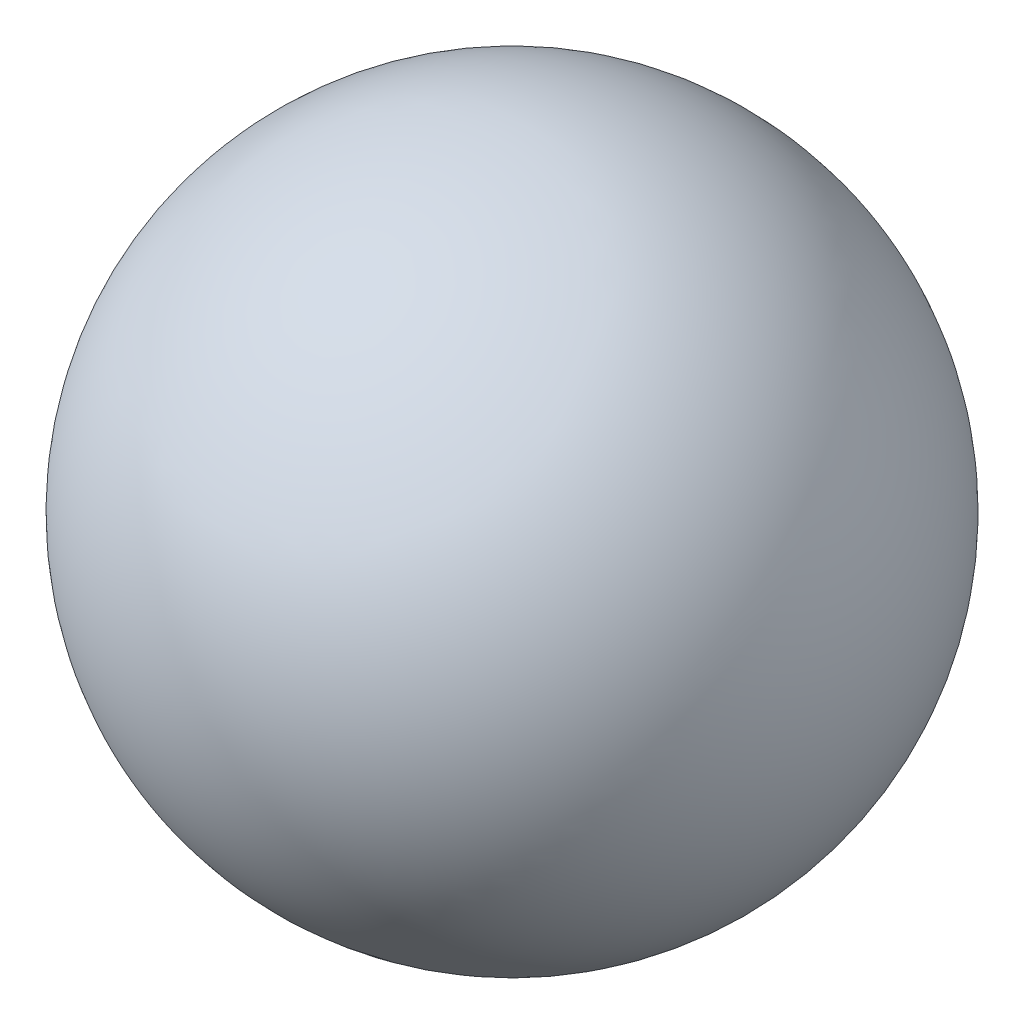
ISO-10303-21;
HEADER;
FILE_DESCRIPTION(('STEP AP214'),'2;1');
FILE_NAME('part.step','',(''),(''),'','','');
FILE_SCHEMA(('AUTOMOTIVE_DESIGN { 1 0 10303 214 1 1 1 1 }'));
ENDSEC;
DATA;
#1=APPLICATION_CONTEXT('core data for automotive mechanical design processes');
#2=APPLICATION_PROTOCOL_DEFINITION('international standard','automotive_design',2000,#1);
#3=PRODUCT_CONTEXT('',#1,'mechanical');
#4=PRODUCT('Part','Part','',(#3));
#5=PRODUCT_RELATED_PRODUCT_CATEGORY('part','',(#4));
#6=PRODUCT_DEFINITION_FORMATION('','',#4);
#7=PRODUCT_DEFINITION_CONTEXT('part definition',#1,'design');
#8=PRODUCT_DEFINITION('design','',#6,#7);
#9=PRODUCT_DEFINITION_SHAPE('','',#8);
#10=(LENGTH_UNIT() NAMED_UNIT(*) SI_UNIT(.MILLI.,.METRE.));
#11=(NAMED_UNIT(*) PLANE_ANGLE_UNIT() SI_UNIT($,.RADIAN.));
#12=(NAMED_UNIT(*) SI_UNIT($,.STERADIAN.) SOLID_ANGLE_UNIT());
#13=UNCERTAINTY_MEASURE_WITH_UNIT(LENGTH_MEASURE(1.E-05),#10,'distance_accuracy_value','');
#14=(GEOMETRIC_REPRESENTATION_CONTEXT(3) GLOBAL_UNCERTAINTY_ASSIGNED_CONTEXT((#13)) GLOBAL_UNIT_ASSIGNED_CONTEXT((#10,
#11,#12)) REPRESENTATION_CONTEXT('',''));
#15=CARTESIAN_POINT('',(0.,0.,0.));
#16=DIRECTION('',(0.,0.,1.));
#17=DIRECTION('',(1.,0.,0.));
#18=AXIS2_PLACEMENT_3D('',#15,#16,#17);
#19=CARTESIAN_POINT('',(57.535,-8.9101747140351,60.882955568988));
#20=DIRECTION('',(0.,-0.144806720363312,0.989459960654104));
#21=DIRECTION('',(0.173648177666934,-0.974427840547316,-0.14260678090206));
#22=AXIS2_PLACEMENT_3D('',#19,#20,#21);
#23=SPHERICAL_SURFACE('',#22,6.75);
#24=CARTESIAN_POINT('',(57.535,-7.93272935158275,54.2041008345728));
#25=VERTEX_POINT('',#24);
#26=VERTEX_LOOP('',#25);
#27=FACE_BOUND('',#26,.T.);
#28=CARTESIAN_POINT('',(57.535,-9.88762007648745,67.5618103034032));
#29=VERTEX_POINT('',#28);
#30=VERTEX_LOOP('',#29);
#31=FACE_BOUND('',#30,.T.);
#32=ADVANCED_FACE('F16',(#27,#31),#23,.T.);
#33=CLOSED_SHELL('',(#32));
#34=MANIFOLD_SOLID_BREP('B1',#33);
#35=ADVANCED_BREP_SHAPE_REPRESENTATION('',(#18,#34),#14);
#36=SHAPE_DEFINITION_REPRESENTATION(#9,#35);
ENDSEC;
END-ISO-10303-21;
